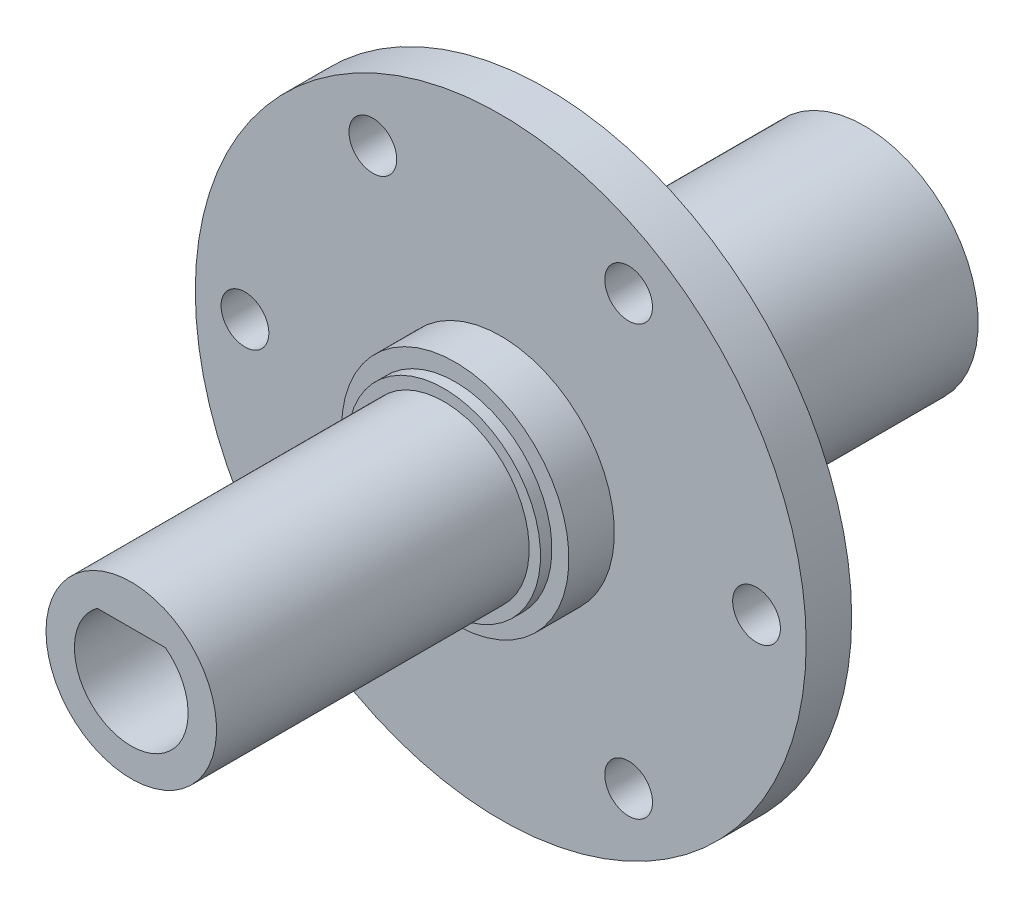
ISO-10303-21;
HEADER;
FILE_DESCRIPTION(('STEP AP214'),'2;1');
FILE_NAME('part.step','',(''),(''),'','','');
FILE_SCHEMA(('AUTOMOTIVE_DESIGN { 1 0 10303 214 1 1 1 1 }'));
ENDSEC;
DATA;
#1=APPLICATION_CONTEXT('core data for automotive mechanical design processes');
#2=APPLICATION_PROTOCOL_DEFINITION('international standard','automotive_design',2000,#1);
#3=PRODUCT_CONTEXT('',#1,'mechanical');
#4=PRODUCT('Part','Part','',(#3));
#5=PRODUCT_RELATED_PRODUCT_CATEGORY('part','',(#4));
#6=PRODUCT_DEFINITION_FORMATION('','',#4);
#7=PRODUCT_DEFINITION_CONTEXT('part definition',#1,'design');
#8=PRODUCT_DEFINITION('design','',#6,#7);
#9=PRODUCT_DEFINITION_SHAPE('','',#8);
#10=(LENGTH_UNIT() NAMED_UNIT(*) SI_UNIT(.MILLI.,.METRE.));
#11=(NAMED_UNIT(*) PLANE_ANGLE_UNIT() SI_UNIT($,.RADIAN.));
#12=(NAMED_UNIT(*) SI_UNIT($,.STERADIAN.) SOLID_ANGLE_UNIT());
#13=UNCERTAINTY_MEASURE_WITH_UNIT(LENGTH_MEASURE(1.E-05),#10,'distance_accuracy_value','');
#14=(GEOMETRIC_REPRESENTATION_CONTEXT(3) GLOBAL_UNCERTAINTY_ASSIGNED_CONTEXT((#13)) GLOBAL_UNIT_ASSIGNED_CONTEXT((#10,
#11,#12)) REPRESENTATION_CONTEXT('',''));
#15=CARTESIAN_POINT('',(0.,0.,0.));
#16=DIRECTION('',(0.,0.,1.));
#17=DIRECTION('',(1.,0.,0.));
#18=AXIS2_PLACEMENT_3D('',#15,#16,#17);
#19=CARTESIAN_POINT('',(-19.2422182468694,0.,20.5157423971377));
#20=DIRECTION('',(0.,0.,1.));
#21=DIRECTION('',(1.,0.,0.));
#22=AXIS2_PLACEMENT_3D('',#19,#20,#21);
#23=PLANE('',#22);
#24=CARTESIAN_POINT('',(-11.7422182468694,0.,20.5157423971377));
#25=DIRECTION('',(0.,0.,-1.));
#26=DIRECTION('',(-1.,0.,0.));
#27=AXIS2_PLACEMENT_3D('',#24,#25,#26);
#28=CIRCLE('',#27,7.49999999999999);
#29=CARTESIAN_POINT('',(-19.2422182468694,0.,20.5157423971377));
#30=VERTEX_POINT('',#29);
#31=EDGE_CURVE('E113',#30,#30,#28,.T.);
#32=ORIENTED_EDGE('',*,*,#31,.F.);
#33=EDGE_LOOP('',(#32));
#34=FACE_BOUND('',#33,.T.);
#35=CARTESIAN_POINT('',(-11.7422182468694,0.,20.5157423971377));
#36=DIRECTION('',(0.,0.,1.));
#37=DIRECTION('',(1.,0.,0.));
#38=AXIS2_PLACEMENT_3D('',#35,#36,#37);
#39=CIRCLE('',#38,5.);
#40=CARTESIAN_POINT('',(-14.7422182468694,4.,20.5157423971377));
#41=VERTEX_POINT('',#40);
#42=CARTESIAN_POINT('',(-8.74221824686939,4.,20.5157423971377));
#43=VERTEX_POINT('',#42);
#44=EDGE_CURVE('E80',#41,#43,#39,.T.);
#45=ORIENTED_EDGE('',*,*,#44,.F.);
#46=DIRECTION('',(1.,0.,0.));
#47=VECTOR('',#46,1.);
#48=CARTESIAN_POINT('',(-11.7422182468694,4.,20.5157423971377));
#49=LINE('',#48,#47);
#50=EDGE_CURVE('E69',#41,#43,#49,.T.);
#51=ORIENTED_EDGE('',*,*,#50,.T.);
#52=EDGE_LOOP('',(#45,#51));
#53=FACE_BOUND('',#52,.T.);
#54=ADVANCED_FACE('F34',(#34,#53),#23,.T.);
#55=CARTESIAN_POINT('',(-11.7422182468694,0.,-18.9793044762542));
#56=DIRECTION('',(0.,0.,-1.));
#57=DIRECTION('',(-1.,0.,0.));
#58=AXIS2_PLACEMENT_3D('',#55,#56,#57);
#59=CYLINDRICAL_SURFACE('',#58,10.);
#60=CARTESIAN_POINT('',(-11.7422182468694,0.,-15.9842576028623));
#61=DIRECTION('',(0.,0.,-1.));
#62=DIRECTION('',(-1.,0.,0.));
#63=AXIS2_PLACEMENT_3D('',#60,#61,#62);
#64=CIRCLE('',#63,10.);
#65=CARTESIAN_POINT('',(-21.7422182468694,0.,-15.9842576028623));
#66=VERTEX_POINT('',#65);
#67=EDGE_CURVE('E88',#66,#66,#64,.T.);
#68=ORIENTED_EDGE('',*,*,#67,.T.);
#69=EDGE_LOOP('',(#68));
#70=FACE_BOUND('',#69,.T.);
#71=CARTESIAN_POINT('',(-11.7422182468694,0.,-43.9842576028623));
#72=DIRECTION('',(0.,0.,-1.));
#73=DIRECTION('',(-1.,0.,0.));
#74=AXIS2_PLACEMENT_3D('',#71,#72,#73);
#75=CIRCLE('',#74,10.);
#76=CARTESIAN_POINT('',(-21.7422182468694,0.,-43.9842576028623));
#77=VERTEX_POINT('',#76);
#78=EDGE_CURVE('E11',#77,#77,#75,.T.);
#79=ORIENTED_EDGE('',*,*,#78,.F.);
#80=EDGE_LOOP('',(#79));
#81=FACE_BOUND('',#80,.T.);
#82=ADVANCED_FACE('F36',(#70,#81),#59,.T.);
#83=CARTESIAN_POINT('',(-21.7422182468694,0.,-43.9842576028623));
#84=DIRECTION('',(0.,0.,-1.));
#85=DIRECTION('',(-1.,0.,0.));
#86=AXIS2_PLACEMENT_3D('',#83,#84,#85);
#87=PLANE('',#86);
#88=ORIENTED_EDGE('',*,*,#78,.T.);
#89=EDGE_LOOP('',(#88));
#90=FACE_BOUND('',#89,.T.);
#91=CARTESIAN_POINT('',(-11.7422182468694,0.,-43.9842576028623));
#92=DIRECTION('',(0.,0.,-1.));
#93=DIRECTION('',(-1.,0.,0.));
#94=AXIS2_PLACEMENT_3D('',#91,#92,#93);
#95=CIRCLE('',#94,7.);
#96=CARTESIAN_POINT('',(-18.7422182468694,0.,-43.9842576028623));
#97=VERTEX_POINT('',#96);
#98=EDGE_CURVE('E43',#97,#97,#95,.T.);
#99=ORIENTED_EDGE('',*,*,#98,.F.);
#100=EDGE_LOOP('',(#99));
#101=FACE_BOUND('',#100,.T.);
#102=ADVANCED_FACE('F169',(#90,#101),#87,.T.);
#103=CARTESIAN_POINT('',(-11.7422182468694,0.,-18.9793044762542));
#104=DIRECTION('',(0.,0.,-1.));
#105=DIRECTION('',(-1.,0.,0.));
#106=AXIS2_PLACEMENT_3D('',#103,#104,#105);
#107=CYLINDRICAL_SURFACE('',#106,7.);
#108=ORIENTED_EDGE('',*,*,#98,.T.);
#109=EDGE_LOOP('',(#108));
#110=FACE_BOUND('',#109,.T.);
#111=CARTESIAN_POINT('',(-11.7422182468694,0.,-23.0342576028623));
#112=DIRECTION('',(0.,0.,-1.));
#113=DIRECTION('',(-1.,0.,0.));
#114=AXIS2_PLACEMENT_3D('',#111,#112,#113);
#115=CIRCLE('',#114,7.);
#116=CARTESIAN_POINT('',(-18.7422182468694,0.,-23.0342576028623));
#117=VERTEX_POINT('',#116);
#118=EDGE_CURVE('E116',#117,#117,#115,.T.);
#119=ORIENTED_EDGE('',*,*,#118,.F.);
#120=EDGE_LOOP('',(#119));
#121=FACE_BOUND('',#120,.T.);
#122=ADVANCED_FACE('F174',(#110,#121),#107,.F.);
#123=CARTESIAN_POINT('',(-11.7422182468694,0.,-18.9793044762542));
#124=DIRECTION('',(0.,0.,-1.));
#125=DIRECTION('',(-1.,0.,0.));
#126=AXIS2_PLACEMENT_3D('',#123,#124,#125);
#127=CONICAL_SURFACE('',#126,0.,1.04575219765091);
#128=ORIENTED_EDGE('',*,*,#118,.T.);
#129=EDGE_LOOP('',(#128));
#130=FACE_BOUND('',#129,.T.);
#131=CARTESIAN_POINT('',(-11.7422182468694,0.,-18.9793044762542));
#132=VERTEX_POINT('',#131);
#133=VERTEX_LOOP('',#132);
#134=FACE_BOUND('',#133,.T.);
#135=ADVANCED_FACE('F179',(#130,#134),#127,.F.);
#136=CARTESIAN_POINT('',(-11.7422182468694,0.,-18.9793044762542));
#137=DIRECTION('',(0.,0.,-1.));
#138=DIRECTION('',(-1.,0.,0.));
#139=AXIS2_PLACEMENT_3D('',#136,#137,#138);
#140=CYLINDRICAL_SURFACE('',#139,7.49999999999999);
#141=ORIENTED_EDGE('',*,*,#31,.T.);
#142=EDGE_LOOP('',(#141));
#143=FACE_BOUND('',#142,.T.);
#144=CARTESIAN_POINT('',(-11.7422182468694,0.,-6.98425760286226));
#145=DIRECTION('',(0.,0.,-1.));
#146=DIRECTION('',(-1.,0.,0.));
#147=AXIS2_PLACEMENT_3D('',#144,#145,#146);
#148=CIRCLE('',#147,7.49999999999999);
#149=CARTESIAN_POINT('',(-19.2422182468694,0.,-6.98425760286226));
#150=VERTEX_POINT('',#149);
#151=EDGE_CURVE('E110',#150,#150,#148,.T.);
#152=ORIENTED_EDGE('',*,*,#151,.F.);
#153=EDGE_LOOP('',(#152));
#154=FACE_BOUND('',#153,.T.);
#155=ADVANCED_FACE('F184',(#143,#154),#140,.T.);
#156=CARTESIAN_POINT('',(-20.2422182468694,0.,-6.98425760286226));
#157=DIRECTION('',(0.,0.,1.));
#158=DIRECTION('',(1.,0.,0.));
#159=AXIS2_PLACEMENT_3D('',#156,#157,#158);
#160=PLANE('',#159);
#161=ORIENTED_EDGE('',*,*,#151,.T.);
#162=EDGE_LOOP('',(#161));
#163=FACE_BOUND('',#162,.T.);
#164=CARTESIAN_POINT('',(-11.7422182468694,0.,-6.98425760286226));
#165=DIRECTION('',(0.,0.,-1.));
#166=DIRECTION('',(-1.,0.,0.));
#167=AXIS2_PLACEMENT_3D('',#164,#165,#166);
#168=CIRCLE('',#167,8.49999999999999);
#169=CARTESIAN_POINT('',(-20.2422182468694,0.,-6.98425760286226));
#170=VERTEX_POINT('',#169);
#171=EDGE_CURVE('E107',#170,#170,#168,.T.);
#172=ORIENTED_EDGE('',*,*,#171,.F.);
#173=EDGE_LOOP('',(#172));
#174=FACE_BOUND('',#173,.T.);
#175=ADVANCED_FACE('F189',(#163,#174),#160,.T.);
#176=CARTESIAN_POINT('',(-11.7422182468694,0.,-18.9793044762542));
#177=DIRECTION('',(0.,0.,-1.));
#178=DIRECTION('',(-1.,0.,0.));
#179=AXIS2_PLACEMENT_3D('',#176,#177,#178);
#180=CYLINDRICAL_SURFACE('',#179,8.49999999999999);
#181=ORIENTED_EDGE('',*,*,#171,.T.);
#182=EDGE_LOOP('',(#181));
#183=FACE_BOUND('',#182,.T.);
#184=CARTESIAN_POINT('',(-11.7422182468694,0.,-7.98425760286226));
#185=DIRECTION('',(0.,0.,-1.));
#186=DIRECTION('',(-1.,0.,0.));
#187=AXIS2_PLACEMENT_3D('',#184,#185,#186);
#188=CIRCLE('',#187,8.49999999999999);
#189=CARTESIAN_POINT('',(-20.2422182468694,0.,-7.98425760286226));
#190=VERTEX_POINT('',#189);
#191=EDGE_CURVE('E104',#190,#190,#188,.T.);
#192=ORIENTED_EDGE('',*,*,#191,.F.);
#193=EDGE_LOOP('',(#192));
#194=FACE_BOUND('',#193,.T.);
#195=ADVANCED_FACE('F202',(#183,#194),#180,.T.);
#196=CARTESIAN_POINT('',(-21.7422182468694,0.,-7.98425760286226));
#197=DIRECTION('',(0.,0.,1.));
#198=DIRECTION('',(1.,0.,0.));
#199=AXIS2_PLACEMENT_3D('',#196,#197,#198);
#200=PLANE('',#199);
#201=ORIENTED_EDGE('',*,*,#191,.T.);
#202=EDGE_LOOP('',(#201));
#203=FACE_BOUND('',#202,.T.);
#204=CARTESIAN_POINT('',(-11.7422182468694,0.,-7.98425760286226));
#205=DIRECTION('',(0.,0.,-1.));
#206=DIRECTION('',(-1.,0.,0.));
#207=AXIS2_PLACEMENT_3D('',#204,#205,#206);
#208=CIRCLE('',#207,10.);
#209=CARTESIAN_POINT('',(-21.7422182468694,0.,-7.98425760286226));
#210=VERTEX_POINT('',#209);
#211=EDGE_CURVE('E101',#210,#210,#208,.T.);
#212=ORIENTED_EDGE('',*,*,#211,.F.);
#213=EDGE_LOOP('',(#212));
#214=FACE_BOUND('',#213,.T.);
#215=ADVANCED_FACE('F206',(#203,#214),#200,.T.);
#216=CARTESIAN_POINT('',(-11.7422182468694,0.,-18.9793044762542));
#217=DIRECTION('',(0.,0.,-1.));
#218=DIRECTION('',(-1.,0.,0.));
#219=AXIS2_PLACEMENT_3D('',#216,#217,#218);
#220=CYLINDRICAL_SURFACE('',#219,10.);
#221=ORIENTED_EDGE('',*,*,#211,.T.);
#222=EDGE_LOOP('',(#221));
#223=FACE_BOUND('',#222,.T.);
#224=CARTESIAN_POINT('',(-11.7422182468694,0.,-11.9842576028623));
#225=DIRECTION('',(0.,0.,-1.));
#226=DIRECTION('',(-1.,0.,0.));
#227=AXIS2_PLACEMENT_3D('',#224,#225,#226);
#228=CIRCLE('',#227,10.);
#229=CARTESIAN_POINT('',(-21.7422182468694,0.,-11.9842576028623));
#230=VERTEX_POINT('',#229);
#231=EDGE_CURVE('E98',#230,#230,#228,.T.);
#232=ORIENTED_EDGE('',*,*,#231,.F.);
#233=EDGE_LOOP('',(#232));
#234=FACE_BOUND('',#233,.T.);
#235=ADVANCED_FACE('F148',(#223,#234),#220,.T.);
#236=CARTESIAN_POINT('',(-38.6122182468694,0.,-11.9842576028623));
#237=DIRECTION('',(0.,0.,1.));
#238=DIRECTION('',(1.,0.,0.));
#239=AXIS2_PLACEMENT_3D('',#236,#237,#238);
#240=PLANE('',#239);
#241=CARTESIAN_POINT('',(-0.492218246869399,18.86,-11.9842576028623));
#242=DIRECTION('',(0.,0.,1.));
#243=DIRECTION('',(-1.,0.,0.));
#244=AXIS2_PLACEMENT_3D('',#241,#242,#243);
#245=CIRCLE('',#244,2.1);
#246=CARTESIAN_POINT('',(-2.5922182468694,18.86,-11.9842576028623));
#247=VERTEX_POINT('',#246);
#248=EDGE_CURVE('E253',#247,#247,#245,.T.);
#249=ORIENTED_EDGE('',*,*,#248,.F.);
#250=EDGE_LOOP('',(#249));
#251=FACE_BOUND('',#250,.T.);
#252=CARTESIAN_POINT('',(-22.9922182468694,18.86,-11.9842576028623));
#253=DIRECTION('',(0.,0.,1.));
#254=DIRECTION('',(1.,0.,0.));
#255=AXIS2_PLACEMENT_3D('',#252,#253,#254);
#256=CIRCLE('',#255,2.1);
#257=CARTESIAN_POINT('',(-20.8922182468694,18.86,-11.9842576028623));
#258=VERTEX_POINT('',#257);
#259=EDGE_CURVE('E249',#258,#258,#256,.T.);
#260=ORIENTED_EDGE('',*,*,#259,.F.);
#261=EDGE_LOOP('',(#260));
#262=FACE_BOUND('',#261,.T.);
#263=CARTESIAN_POINT('',(-34.2422182468694,0.,-11.9842576028623));
#264=DIRECTION('',(0.,0.,1.));
#265=DIRECTION('',(-1.,0.,0.));
#266=AXIS2_PLACEMENT_3D('',#263,#264,#265);
#267=CIRCLE('',#266,2.1);
#268=CARTESIAN_POINT('',(-36.3422182468694,0.,-11.9842576028623));
#269=VERTEX_POINT('',#268);
#270=EDGE_CURVE('E246',#269,#269,#267,.T.);
#271=ORIENTED_EDGE('',*,*,#270,.F.);
#272=EDGE_LOOP('',(#271));
#273=FACE_BOUND('',#272,.T.);
#274=CARTESIAN_POINT('',(-22.9922182468694,-18.86,-11.9842576028623));
#275=DIRECTION('',(0.,0.,1.));
#276=DIRECTION('',(-1.,0.,0.));
#277=AXIS2_PLACEMENT_3D('',#274,#275,#276);
#278=CIRCLE('',#277,2.1);
#279=CARTESIAN_POINT('',(-25.0922182468694,-18.86,-11.9842576028623));
#280=VERTEX_POINT('',#279);
#281=EDGE_CURVE('E248',#280,#280,#278,.T.);
#282=ORIENTED_EDGE('',*,*,#281,.F.);
#283=EDGE_LOOP('',(#282));
#284=FACE_BOUND('',#283,.T.);
#285=CARTESIAN_POINT('',(10.7577817531306,0.,-11.9842576028623));
#286=DIRECTION('',(0.,0.,1.));
#287=DIRECTION('',(1.,0.,0.));
#288=AXIS2_PLACEMENT_3D('',#285,#286,#287);
#289=CIRCLE('',#288,2.1);
#290=CARTESIAN_POINT('',(12.8577817531306,0.,-11.9842576028623));
#291=VERTEX_POINT('',#290);
#292=EDGE_CURVE('E127',#291,#291,#289,.T.);
#293=ORIENTED_EDGE('',*,*,#292,.F.);
#294=EDGE_LOOP('',(#293));
#295=FACE_BOUND('',#294,.T.);
#296=CARTESIAN_POINT('',(-0.492218246869392,-18.86,-11.9842576028623));
#297=DIRECTION('',(0.,0.,1.));
#298=DIRECTION('',(1.,0.,0.));
#299=AXIS2_PLACEMENT_3D('',#296,#297,#298);
#300=CIRCLE('',#299,2.1);
#301=CARTESIAN_POINT('',(1.60778175313061,-18.86,-11.9842576028623));
#302=VERTEX_POINT('',#301);
#303=EDGE_CURVE('E83',#302,#302,#300,.T.);
#304=ORIENTED_EDGE('',*,*,#303,.F.);
#305=EDGE_LOOP('',(#304));
#306=FACE_BOUND('',#305,.T.);
#307=ORIENTED_EDGE('',*,*,#231,.T.);
#308=EDGE_LOOP('',(#307));
#309=FACE_BOUND('',#308,.T.);
#310=CARTESIAN_POINT('',(-11.7422182468694,0.,-11.9842576028623));
#311=DIRECTION('',(0.,0.,-1.));
#312=DIRECTION('',(-1.,0.,0.));
#313=AXIS2_PLACEMENT_3D('',#310,#311,#312);
#314=CIRCLE('',#313,26.87);
#315=CARTESIAN_POINT('',(-38.6122182468694,0.,-11.9842576028623));
#316=VERTEX_POINT('',#315);
#317=EDGE_CURVE('E95',#316,#316,#314,.T.);
#318=ORIENTED_EDGE('',*,*,#317,.F.);
#319=EDGE_LOOP('',(#318));
#320=FACE_BOUND('',#319,.T.);
#321=ADVANCED_FACE('F144',(#251,#262,#273,#284,#295,#306,#309,#320),#240,.T.);
#322=CARTESIAN_POINT('',(-11.7422182468694,0.,-18.9793044762542));
#323=DIRECTION('',(0.,0.,-1.));
#324=DIRECTION('',(-1.,0.,0.));
#325=AXIS2_PLACEMENT_3D('',#322,#323,#324);
#326=CYLINDRICAL_SURFACE('',#325,26.87);
#327=ORIENTED_EDGE('',*,*,#317,.T.);
#328=EDGE_LOOP('',(#327));
#329=FACE_BOUND('',#328,.T.);
#330=CARTESIAN_POINT('',(-11.7422182468694,0.,-15.9842576028623));
#331=DIRECTION('',(0.,0.,-1.));
#332=DIRECTION('',(-1.,0.,0.));
#333=AXIS2_PLACEMENT_3D('',#330,#331,#332);
#334=CIRCLE('',#333,26.87);
#335=CARTESIAN_POINT('',(-38.6122182468694,0.,-15.9842576028623));
#336=VERTEX_POINT('',#335);
#337=EDGE_CURVE('E92',#336,#336,#334,.T.);
#338=ORIENTED_EDGE('',*,*,#337,.F.);
#339=EDGE_LOOP('',(#338));
#340=FACE_BOUND('',#339,.T.);
#341=ADVANCED_FACE('F147',(#329,#340),#326,.T.);
#342=CARTESIAN_POINT('',(-21.7422182468694,0.,-15.9842576028623));
#343=DIRECTION('',(0.,0.,-1.));
#344=DIRECTION('',(-1.,0.,0.));
#345=AXIS2_PLACEMENT_3D('',#342,#343,#344);
#346=PLANE('',#345);
#347=CARTESIAN_POINT('',(-0.492218246869399,18.86,-15.9842576028623));
#348=DIRECTION('',(0.,0.,-1.));
#349=DIRECTION('',(-1.,0.,0.));
#350=AXIS2_PLACEMENT_3D('',#347,#348,#349);
#351=CIRCLE('',#350,2.1);
#352=CARTESIAN_POINT('',(-2.5922182468694,18.86,-15.9842576028623));
#353=VERTEX_POINT('',#352);
#354=EDGE_CURVE('E38',#353,#353,#351,.T.);
#355=ORIENTED_EDGE('',*,*,#354,.F.);
#356=EDGE_LOOP('',(#355));
#357=FACE_BOUND('',#356,.T.);
#358=CARTESIAN_POINT('',(-22.9922182468694,18.86,-15.9842576028623));
#359=DIRECTION('',(0.,0.,-1.));
#360=DIRECTION('',(-1.,0.,0.));
#361=AXIS2_PLACEMENT_3D('',#358,#359,#360);
#362=CIRCLE('',#361,2.1);
#363=CARTESIAN_POINT('',(-25.0922182468694,18.86,-15.9842576028623));
#364=VERTEX_POINT('',#363);
#365=EDGE_CURVE('E132',#364,#364,#362,.T.);
#366=ORIENTED_EDGE('',*,*,#365,.F.);
#367=EDGE_LOOP('',(#366));
#368=FACE_BOUND('',#367,.T.);
#369=CARTESIAN_POINT('',(-34.2422182468694,0.,-15.9842576028623));
#370=DIRECTION('',(0.,0.,-1.));
#371=DIRECTION('',(-1.,0.,0.));
#372=AXIS2_PLACEMENT_3D('',#369,#370,#371);
#373=CIRCLE('',#372,2.1);
#374=CARTESIAN_POINT('',(-36.3422182468694,0.,-15.9842576028623));
#375=VERTEX_POINT('',#374);
#376=EDGE_CURVE('E130',#375,#375,#373,.T.);
#377=ORIENTED_EDGE('',*,*,#376,.F.);
#378=EDGE_LOOP('',(#377));
#379=FACE_BOUND('',#378,.T.);
#380=CARTESIAN_POINT('',(-22.9922182468694,-18.86,-15.9842576028623));
#381=DIRECTION('',(0.,0.,-1.));
#382=DIRECTION('',(-1.,0.,0.));
#383=AXIS2_PLACEMENT_3D('',#380,#381,#382);
#384=CIRCLE('',#383,2.1);
#385=CARTESIAN_POINT('',(-25.0922182468694,-18.86,-15.9842576028623));
#386=VERTEX_POINT('',#385);
#387=EDGE_CURVE('E126',#386,#386,#384,.T.);
#388=ORIENTED_EDGE('',*,*,#387,.F.);
#389=EDGE_LOOP('',(#388));
#390=FACE_BOUND('',#389,.T.);
#391=CARTESIAN_POINT('',(10.7577817531306,0.,-15.9842576028623));
#392=DIRECTION('',(0.,0.,-1.));
#393=DIRECTION('',(-1.,0.,0.));
#394=AXIS2_PLACEMENT_3D('',#391,#392,#393);
#395=CIRCLE('',#394,2.1);
#396=CARTESIAN_POINT('',(8.65778175313061,0.,-15.9842576028623));
#397=VERTEX_POINT('',#396);
#398=EDGE_CURVE('E123',#397,#397,#395,.T.);
#399=ORIENTED_EDGE('',*,*,#398,.F.);
#400=EDGE_LOOP('',(#399));
#401=FACE_BOUND('',#400,.T.);
#402=CARTESIAN_POINT('',(-0.492218246869392,-18.86,-15.9842576028623));
#403=DIRECTION('',(0.,0.,-1.));
#404=DIRECTION('',(-1.,0.,0.));
#405=AXIS2_PLACEMENT_3D('',#402,#403,#404);
#406=CIRCLE('',#405,2.1);
#407=CARTESIAN_POINT('',(-2.59221824686939,-18.86,-15.9842576028623));
#408=VERTEX_POINT('',#407);
#409=EDGE_CURVE('E86',#408,#408,#406,.T.);
#410=ORIENTED_EDGE('',*,*,#409,.F.);
#411=EDGE_LOOP('',(#410));
#412=FACE_BOUND('',#411,.T.);
#413=ORIENTED_EDGE('',*,*,#337,.T.);
#414=EDGE_LOOP('',(#413));
#415=FACE_BOUND('',#414,.T.);
#416=ORIENTED_EDGE('',*,*,#67,.F.);
#417=EDGE_LOOP('',(#416));
#418=FACE_BOUND('',#417,.T.);
#419=ADVANCED_FACE('F157',(#357,#368,#379,#390,#401,#412,#415,#418),#346,.T.);
#420=CARTESIAN_POINT('',(-11.7422182468694,4.,7.11574239713774));
#421=DIRECTION('',(0.,-1.,0.));
#422=DIRECTION('',(0.,0.,-1.));
#423=AXIS2_PLACEMENT_3D('',#420,#421,#422);
#424=PLANE('',#423);
#425=ORIENTED_EDGE('',*,*,#50,.F.);
#426=DIRECTION('',(0.,0.,1.));
#427=VECTOR('',#426,1.);
#428=CARTESIAN_POINT('',(-14.7422182468694,4.,7.11574239713774));
#429=LINE('',#428,#427);
#430=CARTESIAN_POINT('',(-14.7422182468694,4.,7.11574239713774));
#431=VERTEX_POINT('',#430);
#432=EDGE_CURVE('E51',#431,#41,#429,.T.);
#433=ORIENTED_EDGE('',*,*,#432,.F.);
#434=DIRECTION('',(-1.,0.,0.));
#435=VECTOR('',#434,1.);
#436=CARTESIAN_POINT('',(-11.7422182468694,4.,7.11574239713774));
#437=LINE('',#436,#435);
#438=CARTESIAN_POINT('',(-8.74221824686939,4.,7.11574239713774));
#439=VERTEX_POINT('',#438);
#440=EDGE_CURVE('E66',#439,#431,#437,.T.);
#441=ORIENTED_EDGE('',*,*,#440,.F.);
#442=DIRECTION('',(0.,0.,1.));
#443=VECTOR('',#442,1.);
#444=CARTESIAN_POINT('',(-8.74221824686939,4.,7.11574239713774));
#445=LINE('',#444,#443);
#446=EDGE_CURVE('E71',#439,#43,#445,.T.);
#447=ORIENTED_EDGE('',*,*,#446,.T.);
#448=EDGE_LOOP('',(#425,#433,#441,#447));
#449=FACE_BOUND('',#448,.T.);
#450=ADVANCED_FACE('F64',(#449),#424,.T.);
#451=CARTESIAN_POINT('',(-11.7422182468694,0.,7.11574239713774));
#452=DIRECTION('',(0.,0.,1.));
#453=DIRECTION('',(1.,0.,0.));
#454=AXIS2_PLACEMENT_3D('',#451,#452,#453);
#455=CYLINDRICAL_SURFACE('',#454,5.);
#456=ORIENTED_EDGE('',*,*,#44,.T.);
#457=ORIENTED_EDGE('',*,*,#446,.F.);
#458=CARTESIAN_POINT('',(-11.7422182468694,0.,7.11574239713774));
#459=DIRECTION('',(0.,0.,1.));
#460=DIRECTION('',(1.,0.,0.));
#461=AXIS2_PLACEMENT_3D('',#458,#459,#460);
#462=CIRCLE('',#461,5.);
#463=EDGE_CURVE('E72',#431,#439,#462,.T.);
#464=ORIENTED_EDGE('',*,*,#463,.F.);
#465=ORIENTED_EDGE('',*,*,#432,.T.);
#466=EDGE_LOOP('',(#456,#457,#464,#465));
#467=FACE_BOUND('',#466,.T.);
#468=ADVANCED_FACE('F75',(#467),#455,.F.);
#469=CARTESIAN_POINT('',(-11.7422182468694,0.,7.11574239713774));
#470=DIRECTION('',(0.,0.,1.));
#471=DIRECTION('',(1.,0.,0.));
#472=AXIS2_PLACEMENT_3D('',#469,#470,#471);
#473=PLANE('',#472);
#474=ORIENTED_EDGE('',*,*,#440,.T.);
#475=ORIENTED_EDGE('',*,*,#463,.T.);
#476=EDGE_LOOP('',(#474,#475));
#477=FACE_BOUND('',#476,.T.);
#478=ADVANCED_FACE('F78',(#477),#473,.T.);
#479=CARTESIAN_POINT('',(-0.492218246869392,-18.86,-25.3842576028623));
#480=DIRECTION('',(0.,0.,1.));
#481=DIRECTION('',(1.,0.,0.));
#482=AXIS2_PLACEMENT_3D('',#479,#480,#481);
#483=CYLINDRICAL_SURFACE('',#482,2.1);
#484=ORIENTED_EDGE('',*,*,#409,.T.);
#485=EDGE_LOOP('',(#484));
#486=FACE_BOUND('',#485,.T.);
#487=ORIENTED_EDGE('',*,*,#303,.T.);
#488=EDGE_LOOP('',(#487));
#489=FACE_BOUND('',#488,.T.);
#490=ADVANCED_FACE('F142',(#486,#489),#483,.F.);
#491=CARTESIAN_POINT('',(10.7577817531306,0.,-25.3842576028623));
#492=DIRECTION('',(0.,0.,1.));
#493=DIRECTION('',(1.,0.,0.));
#494=AXIS2_PLACEMENT_3D('',#491,#492,#493);
#495=CYLINDRICAL_SURFACE('',#494,2.1);
#496=ORIENTED_EDGE('',*,*,#398,.T.);
#497=EDGE_LOOP('',(#496));
#498=FACE_BOUND('',#497,.T.);
#499=ORIENTED_EDGE('',*,*,#292,.T.);
#500=EDGE_LOOP('',(#499));
#501=FACE_BOUND('',#500,.T.);
#502=ADVANCED_FACE('F222',(#498,#501),#495,.F.);
#503=CARTESIAN_POINT('',(-22.9922182468694,-18.86,-25.3842576028623));
#504=DIRECTION('',(0.,0.,1.));
#505=DIRECTION('',(1.,0.,0.));
#506=AXIS2_PLACEMENT_3D('',#503,#504,#505);
#507=CYLINDRICAL_SURFACE('',#506,2.1);
#508=ORIENTED_EDGE('',*,*,#387,.T.);
#509=EDGE_LOOP('',(#508));
#510=FACE_BOUND('',#509,.T.);
#511=ORIENTED_EDGE('',*,*,#281,.T.);
#512=EDGE_LOOP('',(#511));
#513=FACE_BOUND('',#512,.T.);
#514=ADVANCED_FACE('F224',(#510,#513),#507,.F.);
#515=CARTESIAN_POINT('',(-34.2422182468694,0.,-25.3842576028623));
#516=DIRECTION('',(0.,0.,1.));
#517=DIRECTION('',(1.,0.,0.));
#518=AXIS2_PLACEMENT_3D('',#515,#516,#517);
#519=CYLINDRICAL_SURFACE('',#518,2.1);
#520=ORIENTED_EDGE('',*,*,#376,.T.);
#521=EDGE_LOOP('',(#520));
#522=FACE_BOUND('',#521,.T.);
#523=ORIENTED_EDGE('',*,*,#270,.T.);
#524=EDGE_LOOP('',(#523));
#525=FACE_BOUND('',#524,.T.);
#526=ADVANCED_FACE('F227',(#522,#525),#519,.F.);
#527=CARTESIAN_POINT('',(-22.9922182468694,18.86,-25.3842576028623));
#528=DIRECTION('',(0.,0.,1.));
#529=DIRECTION('',(1.,0.,0.));
#530=AXIS2_PLACEMENT_3D('',#527,#528,#529);
#531=CYLINDRICAL_SURFACE('',#530,2.1);
#532=ORIENTED_EDGE('',*,*,#365,.T.);
#533=EDGE_LOOP('',(#532));
#534=FACE_BOUND('',#533,.T.);
#535=ORIENTED_EDGE('',*,*,#259,.T.);
#536=EDGE_LOOP('',(#535));
#537=FACE_BOUND('',#536,.T.);
#538=ADVANCED_FACE('F235',(#534,#537),#531,.F.);
#539=CARTESIAN_POINT('',(-0.492218246869399,18.86,-25.3842576028623));
#540=DIRECTION('',(0.,0.,1.));
#541=DIRECTION('',(1.,0.,0.));
#542=AXIS2_PLACEMENT_3D('',#539,#540,#541);
#543=CYLINDRICAL_SURFACE('',#542,2.1);
#544=ORIENTED_EDGE('',*,*,#354,.T.);
#545=EDGE_LOOP('',(#544));
#546=FACE_BOUND('',#545,.T.);
#547=ORIENTED_EDGE('',*,*,#248,.T.);
#548=EDGE_LOOP('',(#547));
#549=FACE_BOUND('',#548,.T.);
#550=ADVANCED_FACE('F232',(#546,#549),#543,.F.);
#551=CLOSED_SHELL('',(#54,#82,#102,#122,#135,#155,#175,#195,#215,#235,#321,#341,#419,#450,#468,
#478,#490,#502,#514,#526,#538,#550));
#552=MANIFOLD_SOLID_BREP('B2',#551);
#553=ADVANCED_BREP_SHAPE_REPRESENTATION('',(#18,#552),#14);
#554=SHAPE_DEFINITION_REPRESENTATION(#9,#553);
ENDSEC;
END-ISO-10303-21;
